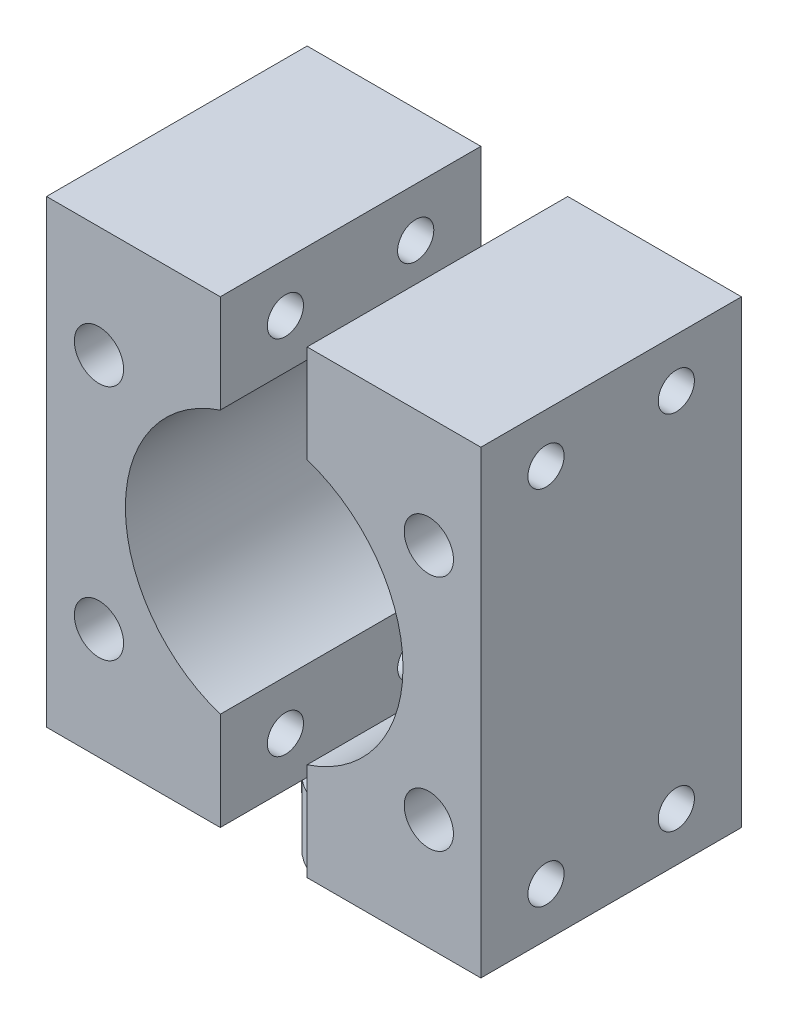
ISO-10303-21;
HEADER;
FILE_DESCRIPTION(('STEP AP214'),'2;1');
FILE_NAME('part.step','',(''),(''),'','','');
FILE_SCHEMA(('AUTOMOTIVE_DESIGN { 1 0 10303 214 1 1 1 1 }'));
ENDSEC;
DATA;
#1=APPLICATION_CONTEXT('core data for automotive mechanical design processes');
#2=APPLICATION_PROTOCOL_DEFINITION('international standard','automotive_design',2000,#1);
#3=PRODUCT_CONTEXT('',#1,'mechanical');
#4=PRODUCT('Part','Part','',(#3));
#5=PRODUCT_RELATED_PRODUCT_CATEGORY('part','',(#4));
#6=PRODUCT_DEFINITION_FORMATION('','',#4);
#7=PRODUCT_DEFINITION_CONTEXT('part definition',#1,'design');
#8=PRODUCT_DEFINITION('design','',#6,#7);
#9=PRODUCT_DEFINITION_SHAPE('','',#8);
#10=(LENGTH_UNIT() NAMED_UNIT(*) SI_UNIT(.MILLI.,.METRE.));
#11=(NAMED_UNIT(*) PLANE_ANGLE_UNIT() SI_UNIT($,.RADIAN.));
#12=(NAMED_UNIT(*) SI_UNIT($,.STERADIAN.) SOLID_ANGLE_UNIT());
#13=UNCERTAINTY_MEASURE_WITH_UNIT(LENGTH_MEASURE(1.E-05),#10,'distance_accuracy_value','');
#14=(GEOMETRIC_REPRESENTATION_CONTEXT(3) GLOBAL_UNCERTAINTY_ASSIGNED_CONTEXT((#13)) GLOBAL_UNIT_ASSIGNED_CONTEXT((#10,
#11,#12)) REPRESENTATION_CONTEXT('',''));
#15=CARTESIAN_POINT('',(0.,0.,0.));
#16=DIRECTION('',(0.,0.,1.));
#17=DIRECTION('',(1.,0.,0.));
#18=AXIS2_PLACEMENT_3D('',#15,#16,#17);
#19=CARTESIAN_POINT('',(-15.,4.5,-8.65612108217187));
#20=DIRECTION('',(0.,-1.,0.));
#21=DIRECTION('',(0.,0.,-1.));
#22=AXIS2_PLACEMENT_3D('',#19,#20,#21);
#23=PLANE('',#22);
#24=DIRECTION('',(0.,0.,-1.));
#25=VECTOR('',#24,1.);
#26=CARTESIAN_POINT('',(-3.,4.5,-8.65612108217187));
#27=LINE('',#26,#25);
#28=CARTESIAN_POINT('',(-3.,4.5,-3.68272996566406));
#29=VERTEX_POINT('',#28);
#30=CARTESIAN_POINT('',(-3.,4.5,-8.65612108217187));
#31=VERTEX_POINT('',#30);
#32=EDGE_CURVE('E204',#29,#31,#27,.T.);
#33=ORIENTED_EDGE('',*,*,#32,.F.);
#34=CARTESIAN_POINT('',(0.,4.5,0.));
#35=DIRECTION('',(0.,1.,0.));
#36=DIRECTION('',(0.,0.,1.));
#37=AXIS2_PLACEMENT_3D('',#34,#35,#36);
#38=CIRCLE('',#37,4.75);
#39=CARTESIAN_POINT('',(-3.,4.5,3.68272996566406));
#40=VERTEX_POINT('',#39);
#41=EDGE_CURVE('E146',#29,#40,#38,.T.);
#42=ORIENTED_EDGE('',*,*,#41,.T.);
#43=CARTESIAN_POINT('',(-3.,4.5,9.34387891782813));
#44=VERTEX_POINT('',#43);
#45=EDGE_CURVE('E194',#44,#40,#27,.T.);
#46=ORIENTED_EDGE('',*,*,#45,.F.);
#47=DIRECTION('',(1.,0.,0.));
#48=VECTOR('',#47,1.);
#49=CARTESIAN_POINT('',(-3.,4.5,9.34387891782813));
#50=LINE('',#49,#48);
#51=CARTESIAN_POINT('',(-15.,4.5,9.34387891782813));
#52=VERTEX_POINT('',#51);
#53=EDGE_CURVE('E203',#52,#44,#50,.T.);
#54=ORIENTED_EDGE('',*,*,#53,.F.);
#55=DIRECTION('',(0.,0.,1.));
#56=VECTOR('',#55,1.);
#57=CARTESIAN_POINT('',(-15.,4.5,9.34387891782813));
#58=LINE('',#57,#56);
#59=CARTESIAN_POINT('',(-15.,4.5,-8.65612108217187));
#60=VERTEX_POINT('',#59);
#61=EDGE_CURVE('E201',#60,#52,#58,.T.);
#62=ORIENTED_EDGE('',*,*,#61,.F.);
#63=DIRECTION('',(-1.,0.,0.));
#64=VECTOR('',#63,1.);
#65=CARTESIAN_POINT('',(-3.,4.5,-8.65612108217187));
#66=LINE('',#65,#64);
#67=EDGE_CURVE('E189',#31,#60,#66,.T.);
#68=ORIENTED_EDGE('',*,*,#67,.F.);
#69=EDGE_LOOP('',(#33,#42,#46,#54,#62,#68));
#70=FACE_BOUND('',#69,.T.);
#71=ADVANCED_FACE('F41',(#70),#23,.T.);
#72=CARTESIAN_POINT('',(-3.,36.25,-8.65612108217187));
#73=DIRECTION('',(0.,0.,1.));
#74=DIRECTION('',(1.,0.,0.));
#75=AXIS2_PLACEMENT_3D('',#72,#73,#74);
#76=PLANE('',#75);
#77=CARTESIAN_POINT('',(-11.3772186390947,28.569859147129,-8.65612108217187));
#78=DIRECTION('',(0.,0.,1.));
#79=DIRECTION('',(1.,0.,0.));
#80=AXIS2_PLACEMENT_3D('',#77,#78,#79);
#81=CIRCLE('',#80,1.7);
#82=CARTESIAN_POINT('',(-9.67721863909473,28.569859147129,-8.65612108217187));
#83=VERTEX_POINT('',#82);
#84=EDGE_CURVE('E415',#83,#83,#81,.T.);
#85=ORIENTED_EDGE('',*,*,#84,.T.);
#86=EDGE_LOOP('',(#85));
#87=FACE_BOUND('',#86,.T.);
#88=CARTESIAN_POINT('',(-11.3772186390947,12.180140852871,-8.65612108217187));
#89=DIRECTION('',(0.,0.,1.));
#90=DIRECTION('',(1.,0.,0.));
#91=AXIS2_PLACEMENT_3D('',#88,#89,#90);
#92=CIRCLE('',#91,1.7);
#93=CARTESIAN_POINT('',(-9.67721863909473,12.180140852871,-8.65612108217187));
#94=VERTEX_POINT('',#93);
#95=EDGE_CURVE('E409',#94,#94,#92,.T.);
#96=ORIENTED_EDGE('',*,*,#95,.T.);
#97=EDGE_LOOP('',(#96));
#98=FACE_BOUND('',#97,.T.);
#99=ORIENTED_EDGE('',*,*,#67,.T.);
#100=DIRECTION('',(0.,-1.,0.));
#101=VECTOR('',#100,1.);
#102=CARTESIAN_POINT('',(-15.,36.25,-8.65612108217187));
#103=LINE('',#102,#101);
#104=CARTESIAN_POINT('',(-15.,36.25,-8.65612108217187));
#105=VERTEX_POINT('',#104);
#106=EDGE_CURVE('E138',#105,#60,#103,.T.);
#107=ORIENTED_EDGE('',*,*,#106,.F.);
#108=DIRECTION('',(-1.,0.,0.));
#109=VECTOR('',#108,1.);
#110=CARTESIAN_POINT('',(-3.,36.25,-8.65612108217187));
#111=LINE('',#110,#109);
#112=CARTESIAN_POINT('',(-3.,36.25,-8.65612108217187));
#113=VERTEX_POINT('',#112);
#114=EDGE_CURVE('E190',#113,#105,#111,.T.);
#115=ORIENTED_EDGE('',*,*,#114,.F.);
#116=DIRECTION('',(0.,-1.,0.));
#117=VECTOR('',#116,1.);
#118=CARTESIAN_POINT('',(-3.,36.25,-8.65612108217187));
#119=LINE('',#118,#117);
#120=EDGE_CURVE('E140',#113,#31,#119,.T.);
#121=ORIENTED_EDGE('',*,*,#120,.T.);
#122=EDGE_LOOP('',(#99,#107,#115,#121));
#123=FACE_BOUND('',#122,.T.);
#124=ADVANCED_FACE('F43',(#87,#98,#123),#76,.F.);
#125=CARTESIAN_POINT('',(-15.,36.25,9.34387891782813));
#126=DIRECTION('',(1.,0.,0.));
#127=DIRECTION('',(0.,0.,-1.));
#128=AXIS2_PLACEMENT_3D('',#125,#126,#127);
#129=PLANE('',#128);
#130=CARTESIAN_POINT('',(-15.,32.8715786406462,4.84387891782813));
#131=DIRECTION('',(1.,0.,0.));
#132=DIRECTION('',(0.,0.,-1.));
#133=AXIS2_PLACEMENT_3D('',#130,#131,#132);
#134=CIRCLE('',#133,1.24999999999999);
#135=CARTESIAN_POINT('',(-15.,32.8715786406462,3.59387891782814));
#136=VERTEX_POINT('',#135);
#137=EDGE_CURVE('E166',#136,#136,#134,.T.);
#138=ORIENTED_EDGE('',*,*,#137,.T.);
#139=EDGE_LOOP('',(#138));
#140=FACE_BOUND('',#139,.T.);
#141=CARTESIAN_POINT('',(-15.,32.8715786406462,-4.15612108217187));
#142=DIRECTION('',(1.,0.,0.));
#143=DIRECTION('',(0.,0.,-1.));
#144=AXIS2_PLACEMENT_3D('',#141,#142,#143);
#145=CIRCLE('',#144,1.24999999999999);
#146=CARTESIAN_POINT('',(-15.,32.8715786406462,-5.40612108217186));
#147=VERTEX_POINT('',#146);
#148=EDGE_CURVE('E156',#147,#147,#145,.T.);
#149=ORIENTED_EDGE('',*,*,#148,.T.);
#150=EDGE_LOOP('',(#149));
#151=FACE_BOUND('',#150,.T.);
#152=CARTESIAN_POINT('',(-15.,7.87842135935374,4.84387891782813));
#153=DIRECTION('',(1.,0.,0.));
#154=DIRECTION('',(0.,0.,-1.));
#155=AXIS2_PLACEMENT_3D('',#152,#153,#154);
#156=CIRCLE('',#155,1.24999999999999);
#157=CARTESIAN_POINT('',(-15.,7.87842135935374,3.59387891782814));
#158=VERTEX_POINT('',#157);
#159=EDGE_CURVE('E153',#158,#158,#156,.T.);
#160=ORIENTED_EDGE('',*,*,#159,.T.);
#161=EDGE_LOOP('',(#160));
#162=FACE_BOUND('',#161,.T.);
#163=CARTESIAN_POINT('',(-15.,7.87842135935374,-4.15612108217187));
#164=DIRECTION('',(1.,0.,0.));
#165=DIRECTION('',(0.,0.,-1.));
#166=AXIS2_PLACEMENT_3D('',#163,#164,#165);
#167=CIRCLE('',#166,1.24999999999999);
#168=CARTESIAN_POINT('',(-15.,7.87842135935374,-5.40612108217186));
#169=VERTEX_POINT('',#168);
#170=EDGE_CURVE('E150',#169,#169,#167,.T.);
#171=ORIENTED_EDGE('',*,*,#170,.T.);
#172=EDGE_LOOP('',(#171));
#173=FACE_BOUND('',#172,.T.);
#174=ORIENTED_EDGE('',*,*,#61,.T.);
#175=DIRECTION('',(0.,-1.,0.));
#176=VECTOR('',#175,1.);
#177=CARTESIAN_POINT('',(-15.,36.25,9.34387891782813));
#178=LINE('',#177,#176);
#179=CARTESIAN_POINT('',(-15.,36.25,9.34387891782813));
#180=VERTEX_POINT('',#179);
#181=EDGE_CURVE('E135',#180,#52,#178,.T.);
#182=ORIENTED_EDGE('',*,*,#181,.F.);
#183=DIRECTION('',(0.,0.,1.));
#184=VECTOR('',#183,1.);
#185=CARTESIAN_POINT('',(-15.,36.25,9.34387891782813));
#186=LINE('',#185,#184);
#187=EDGE_CURVE('E193',#105,#180,#186,.T.);
#188=ORIENTED_EDGE('',*,*,#187,.F.);
#189=ORIENTED_EDGE('',*,*,#106,.T.);
#190=EDGE_LOOP('',(#174,#182,#188,#189));
#191=FACE_BOUND('',#190,.T.);
#192=ADVANCED_FACE('F220',(#140,#151,#162,#173,#191),#129,.F.);
#193=CARTESIAN_POINT('',(-3.,36.25,9.34387891782813));
#194=DIRECTION('',(0.,0.,-1.));
#195=DIRECTION('',(-1.,0.,0.));
#196=AXIS2_PLACEMENT_3D('',#193,#194,#195);
#197=PLANE('',#196);
#198=CARTESIAN_POINT('',(-11.3772186390947,28.569859147129,9.34387891782813));
#199=DIRECTION('',(0.,0.,1.));
#200=DIRECTION('',(1.,0.,0.));
#201=AXIS2_PLACEMENT_3D('',#198,#199,#200);
#202=CIRCLE('',#201,1.69999999999999);
#203=CARTESIAN_POINT('',(-9.67721863909474,28.569859147129,9.34387891782813));
#204=VERTEX_POINT('',#203);
#205=EDGE_CURVE('E420',#204,#204,#202,.T.);
#206=ORIENTED_EDGE('',*,*,#205,.F.);
#207=EDGE_LOOP('',(#206));
#208=FACE_BOUND('',#207,.T.);
#209=CARTESIAN_POINT('',(-11.3772186390947,12.180140852871,9.34387891782813));
#210=DIRECTION('',(0.,0.,1.));
#211=DIRECTION('',(1.,0.,0.));
#212=AXIS2_PLACEMENT_3D('',#209,#210,#211);
#213=CIRCLE('',#212,1.69999999999999);
#214=CARTESIAN_POINT('',(-9.67721863909474,12.180140852871,9.34387891782813));
#215=VERTEX_POINT('',#214);
#216=EDGE_CURVE('E411',#215,#215,#213,.T.);
#217=ORIENTED_EDGE('',*,*,#216,.F.);
#218=EDGE_LOOP('',(#217));
#219=FACE_BOUND('',#218,.T.);
#220=DIRECTION('',(0.,-1.,0.));
#221=VECTOR('',#220,1.);
#222=CARTESIAN_POINT('',(-3.,36.25,9.34387891782813));
#223=LINE('',#222,#221);
#224=CARTESIAN_POINT('',(-3.,11.2790892751317,9.34387891782813));
#225=VERTEX_POINT('',#224);
#226=EDGE_CURVE('E129',#225,#44,#223,.T.);
#227=ORIENTED_EDGE('',*,*,#226,.F.);
#228=CARTESIAN_POINT('',(0.0337666909677441,20.375,9.34387891782813));
#229=DIRECTION('',(0.,0.,1.));
#230=DIRECTION('',(1.,0.,0.));
#231=AXIS2_PLACEMENT_3D('',#228,#229,#230);
#232=CIRCLE('',#231,9.5885);
#233=CARTESIAN_POINT('',(-3.,29.4709107248683,9.34387891782813));
#234=VERTEX_POINT('',#233);
#235=EDGE_CURVE('E115',#234,#225,#232,.T.);
#236=ORIENTED_EDGE('',*,*,#235,.F.);
#237=CARTESIAN_POINT('',(-3.,36.25,9.34387891782813));
#238=VERTEX_POINT('',#237);
#239=EDGE_CURVE('E126',#238,#234,#223,.T.);
#240=ORIENTED_EDGE('',*,*,#239,.F.);
#241=DIRECTION('',(1.,0.,0.));
#242=VECTOR('',#241,1.);
#243=CARTESIAN_POINT('',(-3.,36.25,9.34387891782813));
#244=LINE('',#243,#242);
#245=EDGE_CURVE('E196',#180,#238,#244,.T.);
#246=ORIENTED_EDGE('',*,*,#245,.F.);
#247=ORIENTED_EDGE('',*,*,#181,.T.);
#248=ORIENTED_EDGE('',*,*,#53,.T.);
#249=EDGE_LOOP('',(#227,#236,#240,#246,#247,#248));
#250=FACE_BOUND('',#249,.T.);
#251=ADVANCED_FACE('F124',(#208,#219,#250),#197,.F.);
#252=CARTESIAN_POINT('',(-3.,36.25,-8.65612108217187));
#253=DIRECTION('',(-1.,0.,0.));
#254=DIRECTION('',(0.,0.,1.));
#255=AXIS2_PLACEMENT_3D('',#252,#253,#254);
#256=PLANE('',#255);
#257=CARTESIAN_POINT('',(-3.,32.8715786406462,4.84387891782813));
#258=DIRECTION('',(-1.,0.,0.));
#259=DIRECTION('',(0.,0.,1.));
#260=AXIS2_PLACEMENT_3D('',#257,#258,#259);
#261=CIRCLE('',#260,1.24999999999999);
#262=CARTESIAN_POINT('',(-3.,32.8715786406462,6.09387891782812));
#263=VERTEX_POINT('',#262);
#264=EDGE_CURVE('E45',#263,#263,#261,.T.);
#265=ORIENTED_EDGE('',*,*,#264,.T.);
#266=EDGE_LOOP('',(#265));
#267=FACE_BOUND('',#266,.T.);
#268=CARTESIAN_POINT('',(-3.,32.8715786406462,-4.15612108217187));
#269=DIRECTION('',(-1.,0.,0.));
#270=DIRECTION('',(0.,0.,1.));
#271=AXIS2_PLACEMENT_3D('',#268,#269,#270);
#272=CIRCLE('',#271,1.24999999999999);
#273=CARTESIAN_POINT('',(-3.,32.8715786406462,-2.90612108217188));
#274=VERTEX_POINT('',#273);
#275=EDGE_CURVE('E154',#274,#274,#272,.T.);
#276=ORIENTED_EDGE('',*,*,#275,.T.);
#277=EDGE_LOOP('',(#276));
#278=FACE_BOUND('',#277,.T.);
#279=CARTESIAN_POINT('',(-3.,7.87842135935374,4.84387891782813));
#280=DIRECTION('',(-1.,0.,0.));
#281=DIRECTION('',(0.,0.,1.));
#282=AXIS2_PLACEMENT_3D('',#279,#280,#281);
#283=CIRCLE('',#282,1.24999999999999);
#284=CARTESIAN_POINT('',(-3.,7.87842135935374,6.09387891782812));
#285=VERTEX_POINT('',#284);
#286=EDGE_CURVE('E151',#285,#285,#283,.T.);
#287=ORIENTED_EDGE('',*,*,#286,.T.);
#288=EDGE_LOOP('',(#287));
#289=FACE_BOUND('',#288,.T.);
#290=CARTESIAN_POINT('',(-3.,7.87842135935374,-4.15612108217187));
#291=DIRECTION('',(-1.,0.,0.));
#292=DIRECTION('',(0.,0.,1.));
#293=AXIS2_PLACEMENT_3D('',#290,#291,#292);
#294=CIRCLE('',#293,1.24999999999999);
#295=CARTESIAN_POINT('',(-3.,7.87842135935374,-2.90612108217188));
#296=VERTEX_POINT('',#295);
#297=EDGE_CURVE('E130',#296,#296,#294,.T.);
#298=ORIENTED_EDGE('',*,*,#297,.T.);
#299=EDGE_LOOP('',(#298));
#300=FACE_BOUND('',#299,.T.);
#301=DIRECTION('',(0.,1.,0.));
#302=VECTOR('',#301,1.);
#303=CARTESIAN_POINT('',(-3.,36.25,-7.65612108217187));
#304=LINE('',#303,#302);
#305=CARTESIAN_POINT('',(-3.,11.2790892751317,-7.65612108217187));
#306=VERTEX_POINT('',#305);
#307=CARTESIAN_POINT('',(-3.,29.4709107248683,-7.65612108217187));
#308=VERTEX_POINT('',#307);
#309=EDGE_CURVE('E119',#306,#308,#304,.T.);
#310=ORIENTED_EDGE('',*,*,#309,.F.);
#311=DIRECTION('',(0.,0.,1.));
#312=VECTOR('',#311,1.);
#313=CARTESIAN_POINT('',(-3.,11.2790892751317,-7.65612108217187));
#314=LINE('',#313,#312);
#315=EDGE_CURVE('E12',#306,#225,#314,.T.);
#316=ORIENTED_EDGE('',*,*,#315,.T.);
#317=ORIENTED_EDGE('',*,*,#226,.T.);
#318=ORIENTED_EDGE('',*,*,#45,.T.);
#319=EDGE_CURVE('E206',#40,#29,#27,.T.);
#320=ORIENTED_EDGE('',*,*,#319,.T.);
#321=ORIENTED_EDGE('',*,*,#32,.T.);
#322=ORIENTED_EDGE('',*,*,#120,.F.);
#323=DIRECTION('',(0.,0.,-1.));
#324=VECTOR('',#323,1.);
#325=CARTESIAN_POINT('',(-3.,36.25,-8.65612108217187));
#326=LINE('',#325,#324);
#327=EDGE_CURVE('E134',#238,#113,#326,.T.);
#328=ORIENTED_EDGE('',*,*,#327,.F.);
#329=ORIENTED_EDGE('',*,*,#239,.T.);
#330=DIRECTION('',(0.,0.,1.));
#331=VECTOR('',#330,1.);
#332=CARTESIAN_POINT('',(-3.,29.4709107248683,-7.65612108217187));
#333=LINE('',#332,#331);
#334=EDGE_CURVE('E50',#234,#308,#333,.F.);
#335=ORIENTED_EDGE('',*,*,#334,.T.);
#336=EDGE_LOOP('',(#310,#316,#317,#318,#320,#321,#322,#328,#329,#335));
#337=FACE_BOUND('',#336,.T.);
#338=ADVANCED_FACE('F132',(#267,#278,#289,#300,#337),#256,.F.);
#339=CARTESIAN_POINT('',(-15.,36.25,-8.65612108217187));
#340=DIRECTION('',(0.,-1.,0.));
#341=DIRECTION('',(0.,0.,-1.));
#342=AXIS2_PLACEMENT_3D('',#339,#340,#341);
#343=PLANE('',#342);
#344=ORIENTED_EDGE('',*,*,#114,.T.);
#345=ORIENTED_EDGE('',*,*,#187,.T.);
#346=ORIENTED_EDGE('',*,*,#245,.T.);
#347=ORIENTED_EDGE('',*,*,#327,.T.);
#348=EDGE_LOOP('',(#344,#345,#346,#347));
#349=FACE_BOUND('',#348,.T.);
#350=ADVANCED_FACE('F222',(#349),#343,.F.);
#351=CARTESIAN_POINT('',(-10.5914213562373,4.5,0.));
#352=DIRECTION('',(0.,1.,0.));
#353=DIRECTION('',(0.,0.,1.));
#354=AXIS2_PLACEMENT_3D('',#351,#352,#353);
#355=PLANE('',#354);
#356=ORIENTED_EDGE('',*,*,#319,.F.);
#357=CARTESIAN_POINT('',(-1.5,4.5,4.50693909432999));
#358=VERTEX_POINT('',#357);
#359=EDGE_CURVE('E65',#40,#358,#38,.T.);
#360=ORIENTED_EDGE('',*,*,#359,.T.);
#361=DIRECTION('',(0.,0.,1.));
#362=VECTOR('',#361,1.);
#363=CARTESIAN_POINT('',(-1.5,4.5,0.));
#364=LINE('',#363,#362);
#365=CARTESIAN_POINT('',(-1.5,4.5,-4.50693909432999));
#366=VERTEX_POINT('',#365);
#367=EDGE_CURVE('E174',#366,#358,#364,.T.);
#368=ORIENTED_EDGE('',*,*,#367,.F.);
#369=EDGE_CURVE('E178',#366,#29,#38,.T.);
#370=ORIENTED_EDGE('',*,*,#369,.T.);
#371=EDGE_LOOP('',(#356,#360,#368,#370));
#372=FACE_BOUND('',#371,.T.);
#373=ADVANCED_FACE('F226',(#372),#355,.T.);
#374=CARTESIAN_POINT('',(-1.5,4.5,0.));
#375=DIRECTION('',(1.,0.,0.));
#376=DIRECTION('',(0.,0.,-1.));
#377=AXIS2_PLACEMENT_3D('',#374,#375,#376);
#378=PLANE('',#377);
#379=DIRECTION('',(0.,0.,1.));
#380=VECTOR('',#379,1.);
#381=CARTESIAN_POINT('',(-1.5,0.,0.));
#382=LINE('',#381,#380);
#383=CARTESIAN_POINT('',(-1.5,0.,-4.50693909432999));
#384=VERTEX_POINT('',#383);
#385=CARTESIAN_POINT('',(-1.5,0.,4.50693909432999));
#386=VERTEX_POINT('',#385);
#387=EDGE_CURVE('E172',#384,#386,#382,.T.);
#388=ORIENTED_EDGE('',*,*,#387,.F.);
#389=DIRECTION('',(0.,-1.,0.));
#390=VECTOR('',#389,1.);
#391=CARTESIAN_POINT('',(-1.5,4.5,-4.50693909432999));
#392=LINE('',#391,#390);
#393=EDGE_CURVE('E187',#366,#384,#392,.T.);
#394=ORIENTED_EDGE('',*,*,#393,.F.);
#395=ORIENTED_EDGE('',*,*,#367,.T.);
#396=DIRECTION('',(0.,-1.,0.));
#397=VECTOR('',#396,1.);
#398=CARTESIAN_POINT('',(-1.5,4.5,4.50693909432999));
#399=LINE('',#398,#397);
#400=EDGE_CURVE('E181',#358,#386,#399,.T.);
#401=ORIENTED_EDGE('',*,*,#400,.T.);
#402=EDGE_LOOP('',(#388,#394,#395,#401));
#403=FACE_BOUND('',#402,.T.);
#404=ADVANCED_FACE('F231',(#403),#378,.T.);
#405=CARTESIAN_POINT('',(0.,4.5,0.));
#406=DIRECTION('',(0.,-1.,0.));
#407=DIRECTION('',(0.,0.,-1.));
#408=AXIS2_PLACEMENT_3D('',#405,#406,#407);
#409=CYLINDRICAL_SURFACE('',#408,4.75);
#410=CARTESIAN_POINT('',(0.,0.,0.));
#411=DIRECTION('',(0.,1.,0.));
#412=DIRECTION('',(0.,0.,1.));
#413=AXIS2_PLACEMENT_3D('',#410,#411,#412);
#414=CIRCLE('',#413,4.75);
#415=EDGE_CURVE('E177',#384,#386,#414,.T.);
#416=ORIENTED_EDGE('',*,*,#415,.T.);
#417=ORIENTED_EDGE('',*,*,#400,.F.);
#418=ORIENTED_EDGE('',*,*,#359,.F.);
#419=ORIENTED_EDGE('',*,*,#41,.F.);
#420=ORIENTED_EDGE('',*,*,#369,.F.);
#421=ORIENTED_EDGE('',*,*,#393,.T.);
#422=EDGE_LOOP('',(#416,#417,#418,#419,#420,#421));
#423=FACE_BOUND('',#422,.T.);
#424=ADVANCED_FACE('F227',(#423),#409,.T.);
#425=CARTESIAN_POINT('',(-10.5914213562373,0.,0.));
#426=DIRECTION('',(0.,1.,0.));
#427=DIRECTION('',(0.,0.,1.));
#428=AXIS2_PLACEMENT_3D('',#425,#426,#427);
#429=PLANE('',#428);
#430=ORIENTED_EDGE('',*,*,#387,.T.);
#431=ORIENTED_EDGE('',*,*,#415,.F.);
#432=EDGE_LOOP('',(#430,#431));
#433=FACE_BOUND('',#432,.T.);
#434=ADVANCED_FACE('F233',(#433),#429,.F.);
#435=CARTESIAN_POINT('',(0.0337666909677441,20.375,-7.65612108217187));
#436=DIRECTION('',(0.,0.,1.));
#437=DIRECTION('',(1.,0.,0.));
#438=AXIS2_PLACEMENT_3D('',#435,#436,#437);
#439=CYLINDRICAL_SURFACE('',#438,9.5885);
#440=CARTESIAN_POINT('',(0.0337666909677441,20.375,-7.65612108217187));
#441=DIRECTION('',(0.,0.,1.));
#442=DIRECTION('',(1.,0.,0.));
#443=AXIS2_PLACEMENT_3D('',#440,#441,#442);
#444=CIRCLE('',#443,9.5885);
#445=EDGE_CURVE('E57',#308,#306,#444,.T.);
#446=ORIENTED_EDGE('',*,*,#445,.F.);
#447=ORIENTED_EDGE('',*,*,#334,.F.);
#448=ORIENTED_EDGE('',*,*,#235,.T.);
#449=ORIENTED_EDGE('',*,*,#315,.F.);
#450=EDGE_LOOP('',(#446,#447,#448,#449));
#451=FACE_BOUND('',#450,.T.);
#452=ADVANCED_FACE('F114',(#451),#439,.F.);
#453=CARTESIAN_POINT('',(0.0337666909677441,20.375,-7.65612108217187));
#454=DIRECTION('',(0.,0.,1.));
#455=DIRECTION('',(1.,0.,0.));
#456=AXIS2_PLACEMENT_3D('',#453,#454,#455);
#457=PLANE('',#456);
#458=ORIENTED_EDGE('',*,*,#309,.T.);
#459=ORIENTED_EDGE('',*,*,#445,.T.);
#460=EDGE_LOOP('',(#458,#459));
#461=FACE_BOUND('',#460,.T.);
#462=ADVANCED_FACE('F240',(#461),#457,.T.);
#463=CARTESIAN_POINT('',(15.,7.87842135935374,-4.15612108217187));
#464=DIRECTION('',(1.,0.,0.));
#465=DIRECTION('',(0.,0.,-1.));
#466=AXIS2_PLACEMENT_3D('',#463,#464,#465);
#467=CYLINDRICAL_SURFACE('',#466,1.24999999999999);
#468=ORIENTED_EDGE('',*,*,#170,.F.);
#469=EDGE_LOOP('',(#468));
#470=FACE_BOUND('',#469,.T.);
#471=ORIENTED_EDGE('',*,*,#297,.F.);
#472=EDGE_LOOP('',(#471));
#473=FACE_BOUND('',#472,.T.);
#474=ADVANCED_FACE('F269',(#470,#473),#467,.F.);
#475=CARTESIAN_POINT('',(15.,7.87842135935374,4.84387891782813));
#476=DIRECTION('',(1.,0.,0.));
#477=DIRECTION('',(0.,0.,-1.));
#478=AXIS2_PLACEMENT_3D('',#475,#476,#477);
#479=CYLINDRICAL_SURFACE('',#478,1.24999999999999);
#480=ORIENTED_EDGE('',*,*,#159,.F.);
#481=EDGE_LOOP('',(#480));
#482=FACE_BOUND('',#481,.T.);
#483=ORIENTED_EDGE('',*,*,#286,.F.);
#484=EDGE_LOOP('',(#483));
#485=FACE_BOUND('',#484,.T.);
#486=ADVANCED_FACE('F272',(#482,#485),#479,.F.);
#487=CARTESIAN_POINT('',(15.,32.8715786406462,-4.15612108217187));
#488=DIRECTION('',(1.,0.,0.));
#489=DIRECTION('',(0.,0.,-1.));
#490=AXIS2_PLACEMENT_3D('',#487,#488,#489);
#491=CYLINDRICAL_SURFACE('',#490,1.24999999999999);
#492=ORIENTED_EDGE('',*,*,#148,.F.);
#493=EDGE_LOOP('',(#492));
#494=FACE_BOUND('',#493,.T.);
#495=ORIENTED_EDGE('',*,*,#275,.F.);
#496=EDGE_LOOP('',(#495));
#497=FACE_BOUND('',#496,.T.);
#498=ADVANCED_FACE('F280',(#494,#497),#491,.F.);
#499=CARTESIAN_POINT('',(15.,32.8715786406462,4.84387891782813));
#500=DIRECTION('',(1.,0.,0.));
#501=DIRECTION('',(0.,0.,-1.));
#502=AXIS2_PLACEMENT_3D('',#499,#500,#501);
#503=CYLINDRICAL_SURFACE('',#502,1.24999999999999);
#504=ORIENTED_EDGE('',*,*,#137,.F.);
#505=EDGE_LOOP('',(#504));
#506=FACE_BOUND('',#505,.T.);
#507=ORIENTED_EDGE('',*,*,#264,.F.);
#508=EDGE_LOOP('',(#507));
#509=FACE_BOUND('',#508,.T.);
#510=ADVANCED_FACE('F316',(#506,#509),#503,.F.);
#511=CARTESIAN_POINT('',(-11.3772186390947,12.180140852871,9.34387891782813));
#512=DIRECTION('',(0.,0.,1.));
#513=DIRECTION('',(1.,0.,0.));
#514=AXIS2_PLACEMENT_3D('',#511,#512,#513);
#515=CYLINDRICAL_SURFACE('',#514,1.69999999999999);
#516=ORIENTED_EDGE('',*,*,#95,.F.);
#517=EDGE_LOOP('',(#516));
#518=FACE_BOUND('',#517,.T.);
#519=ORIENTED_EDGE('',*,*,#216,.T.);
#520=EDGE_LOOP('',(#519));
#521=FACE_BOUND('',#520,.T.);
#522=ADVANCED_FACE('F310',(#518,#521),#515,.F.);
#523=CARTESIAN_POINT('',(-11.3772186390947,28.569859147129,9.34387891782813));
#524=DIRECTION('',(0.,0.,1.));
#525=DIRECTION('',(1.,0.,0.));
#526=AXIS2_PLACEMENT_3D('',#523,#524,#525);
#527=CYLINDRICAL_SURFACE('',#526,1.69999999999999);
#528=ORIENTED_EDGE('',*,*,#84,.F.);
#529=EDGE_LOOP('',(#528));
#530=FACE_BOUND('',#529,.T.);
#531=ORIENTED_EDGE('',*,*,#205,.T.);
#532=EDGE_LOOP('',(#531));
#533=FACE_BOUND('',#532,.T.);
#534=ADVANCED_FACE('F315',(#530,#533),#527,.F.);
#535=CLOSED_SHELL('',(#71,#124,#192,#251,#338,#350,#373,#404,#424,#434,#452,#462,#474,#486,#498,
#510,#522,#534));
#536=MANIFOLD_SOLID_BREP('B2',#535);
#537=CARTESIAN_POINT('',(3.,36.25,-8.65612108217187));
#538=DIRECTION('',(0.,0.,1.));
#539=DIRECTION('',(1.,0.,0.));
#540=AXIS2_PLACEMENT_3D('',#537,#538,#539);
#541=PLANE('',#540);
#542=CARTESIAN_POINT('',(11.4050067096299,12.171834609744,-8.65612108217187));
#543=DIRECTION('',(0.,0.,1.));
#544=DIRECTION('',(1.,0.,0.));
#545=AXIS2_PLACEMENT_3D('',#542,#543,#544);
#546=CIRCLE('',#545,1.7);
#547=CARTESIAN_POINT('',(13.1050067096299,12.171834609744,-8.65612108217187));
#548=VERTEX_POINT('',#547);
#549=EDGE_CURVE('E600',#548,#548,#546,.T.);
#550=ORIENTED_EDGE('',*,*,#549,.T.);
#551=EDGE_LOOP('',(#550));
#552=FACE_BOUND('',#551,.T.);
#553=CARTESIAN_POINT('',(11.4050067096299,28.578165390256,-8.65612108217187));
#554=DIRECTION('',(0.,0.,1.));
#555=DIRECTION('',(1.,0.,0.));
#556=AXIS2_PLACEMENT_3D('',#553,#554,#555);
#557=CIRCLE('',#556,1.7);
#558=CARTESIAN_POINT('',(13.1050067096299,28.578165390256,-8.65612108217187));
#559=VERTEX_POINT('',#558);
#560=EDGE_CURVE('E594',#559,#559,#557,.T.);
#561=ORIENTED_EDGE('',*,*,#560,.T.);
#562=EDGE_LOOP('',(#561));
#563=FACE_BOUND('',#562,.T.);
#564=DIRECTION('',(-1.,0.,0.));
#565=VECTOR('',#564,1.);
#566=CARTESIAN_POINT('',(3.,4.5,-8.65612108217187));
#567=LINE('',#566,#565);
#568=CARTESIAN_POINT('',(15.,4.5,-8.65612108217187));
#569=VERTEX_POINT('',#568);
#570=CARTESIAN_POINT('',(3.,4.5,-8.65612108217187));
#571=VERTEX_POINT('',#570);
#572=EDGE_CURVE('E538',#569,#571,#567,.T.);
#573=ORIENTED_EDGE('',*,*,#572,.T.);
#574=DIRECTION('',(0.,-1.,0.));
#575=VECTOR('',#574,1.);
#576=CARTESIAN_POINT('',(3.,36.25,-8.65612108217187));
#577=LINE('',#576,#575);
#578=CARTESIAN_POINT('',(3.,36.25,-8.65612108217187));
#579=VERTEX_POINT('',#578);
#580=EDGE_CURVE('E567',#579,#571,#577,.T.);
#581=ORIENTED_EDGE('',*,*,#580,.F.);
#582=DIRECTION('',(-1.,0.,0.));
#583=VECTOR('',#582,1.);
#584=CARTESIAN_POINT('',(3.,36.25,-8.65612108217187));
#585=LINE('',#584,#583);
#586=CARTESIAN_POINT('',(15.,36.25,-8.65612108217187));
#587=VERTEX_POINT('',#586);
#588=EDGE_CURVE('E539',#587,#579,#585,.T.);
#589=ORIENTED_EDGE('',*,*,#588,.F.);
#590=DIRECTION('',(0.,-1.,0.));
#591=VECTOR('',#590,1.);
#592=CARTESIAN_POINT('',(15.,36.25,-8.65612108217187));
#593=LINE('',#592,#591);
#594=EDGE_CURVE('E549',#587,#569,#593,.T.);
#595=ORIENTED_EDGE('',*,*,#594,.T.);
#596=EDGE_LOOP('',(#573,#581,#589,#595));
#597=FACE_BOUND('',#596,.T.);
#598=ADVANCED_FACE('F430',(#552,#563,#597),#541,.F.);
#599=CARTESIAN_POINT('',(3.,36.25,-8.65612108217187));
#600=DIRECTION('',(1.,0.,0.));
#601=DIRECTION('',(0.,0.,-1.));
#602=AXIS2_PLACEMENT_3D('',#599,#600,#601);
#603=PLANE('',#602);
#604=CARTESIAN_POINT('',(3.,32.8715786406462,4.84387891782813));
#605=DIRECTION('',(1.,0.,0.));
#606=DIRECTION('',(0.,0.,-1.));
#607=AXIS2_PLACEMENT_3D('',#604,#605,#606);
#608=CIRCLE('',#607,1.24999999999999);
#609=CARTESIAN_POINT('',(3.,32.8715786406462,3.59387891782814));
#610=VERTEX_POINT('',#609);
#611=EDGE_CURVE('E588',#610,#610,#608,.T.);
#612=ORIENTED_EDGE('',*,*,#611,.T.);
#613=EDGE_LOOP('',(#612));
#614=FACE_BOUND('',#613,.T.);
#615=CARTESIAN_POINT('',(3.,32.8715786406462,-4.15612108217187));
#616=DIRECTION('',(1.,0.,0.));
#617=DIRECTION('',(0.,0.,-1.));
#618=AXIS2_PLACEMENT_3D('',#615,#616,#617);
#619=CIRCLE('',#618,1.24999999999999);
#620=CARTESIAN_POINT('',(3.,32.8715786406462,-5.40612108217186));
#621=VERTEX_POINT('',#620);
#622=EDGE_CURVE('E582',#621,#621,#619,.T.);
#623=ORIENTED_EDGE('',*,*,#622,.T.);
#624=EDGE_LOOP('',(#623));
#625=FACE_BOUND('',#624,.T.);
#626=CARTESIAN_POINT('',(3.,7.87842135935374,4.84387891782813));
#627=DIRECTION('',(1.,0.,0.));
#628=DIRECTION('',(0.,0.,-1.));
#629=AXIS2_PLACEMENT_3D('',#626,#627,#628);
#630=CIRCLE('',#629,1.24999999999999);
#631=CARTESIAN_POINT('',(3.,7.87842135935374,3.59387891782814));
#632=VERTEX_POINT('',#631);
#633=EDGE_CURVE('E433',#632,#632,#630,.T.);
#634=ORIENTED_EDGE('',*,*,#633,.T.);
#635=EDGE_LOOP('',(#634));
#636=FACE_BOUND('',#635,.T.);
#637=CARTESIAN_POINT('',(3.,7.87842135935374,-4.15612108217187));
#638=DIRECTION('',(1.,0.,0.));
#639=DIRECTION('',(0.,0.,-1.));
#640=AXIS2_PLACEMENT_3D('',#637,#638,#639);
#641=CIRCLE('',#640,1.24999999999999);
#642=CARTESIAN_POINT('',(3.,7.87842135935374,-5.40612108217186));
#643=VERTEX_POINT('',#642);
#644=EDGE_CURVE('E512',#643,#643,#641,.T.);
#645=ORIENTED_EDGE('',*,*,#644,.T.);
#646=EDGE_LOOP('',(#645));
#647=FACE_BOUND('',#646,.T.);
#648=DIRECTION('',(0.,-1.,0.));
#649=VECTOR('',#648,1.);
#650=CARTESIAN_POINT('',(3.,36.25,-7.65612108217187));
#651=LINE('',#650,#649);
#652=CARTESIAN_POINT('',(3.,29.4931572812925,-7.65612108217187));
#653=VERTEX_POINT('',#652);
#654=CARTESIAN_POINT('',(3.,11.2568427187075,-7.65612108217187));
#655=VERTEX_POINT('',#654);
#656=EDGE_CURVE('E39',#653,#655,#651,.T.);
#657=ORIENTED_EDGE('',*,*,#656,.F.);
#658=DIRECTION('',(0.,0.,1.));
#659=VECTOR('',#658,1.);
#660=CARTESIAN_POINT('',(3.,29.4931572812925,-7.65612108217187));
#661=LINE('',#660,#659);
#662=CARTESIAN_POINT('',(3.,29.4931572812925,9.34387891782813));
#663=VERTEX_POINT('',#662);
#664=EDGE_CURVE('E500',#653,#663,#661,.T.);
#665=ORIENTED_EDGE('',*,*,#664,.T.);
#666=DIRECTION('',(0.,-1.,0.));
#667=VECTOR('',#666,1.);
#668=CARTESIAN_POINT('',(3.,36.25,9.34387891782813));
#669=LINE('',#668,#667);
#670=CARTESIAN_POINT('',(3.,36.25,9.34387891782813));
#671=VERTEX_POINT('',#670);
#672=EDGE_CURVE('E565',#671,#663,#669,.T.);
#673=ORIENTED_EDGE('',*,*,#672,.F.);
#674=DIRECTION('',(0.,0.,1.));
#675=VECTOR('',#674,1.);
#676=CARTESIAN_POINT('',(3.,36.25,-8.65612108217187));
#677=LINE('',#676,#675);
#678=EDGE_CURVE('E542',#579,#671,#677,.T.);
#679=ORIENTED_EDGE('',*,*,#678,.F.);
#680=ORIENTED_EDGE('',*,*,#580,.T.);
#681=DIRECTION('',(0.,0.,1.));
#682=VECTOR('',#681,1.);
#683=CARTESIAN_POINT('',(3.,4.5,-8.65612108217187));
#684=LINE('',#683,#682);
#685=CARTESIAN_POINT('',(3.,4.5,-3.68272996566406));
#686=VERTEX_POINT('',#685);
#687=EDGE_CURVE('E553',#571,#686,#684,.T.);
#688=ORIENTED_EDGE('',*,*,#687,.T.);
#689=CARTESIAN_POINT('',(3.,4.5,3.68272996566406));
#690=VERTEX_POINT('',#689);
#691=EDGE_CURVE('E557',#686,#690,#684,.T.);
#692=ORIENTED_EDGE('',*,*,#691,.T.);
#693=CARTESIAN_POINT('',(3.,4.5,9.34387891782813));
#694=VERTEX_POINT('',#693);
#695=EDGE_CURVE('E552',#690,#694,#684,.T.);
#696=ORIENTED_EDGE('',*,*,#695,.T.);
#697=CARTESIAN_POINT('',(3.,11.2568427187075,9.34387891782813));
#698=VERTEX_POINT('',#697);
#699=EDGE_CURVE('E517',#698,#694,#669,.T.);
#700=ORIENTED_EDGE('',*,*,#699,.F.);
#701=DIRECTION('',(0.,0.,1.));
#702=VECTOR('',#701,1.);
#703=CARTESIAN_POINT('',(3.,11.2568427187075,-7.65612108217187));
#704=LINE('',#703,#702);
#705=EDGE_CURVE('E446',#698,#655,#704,.F.);
#706=ORIENTED_EDGE('',*,*,#705,.T.);
#707=EDGE_LOOP('',(#657,#665,#673,#679,#680,#688,#692,#696,#700,#706));
#708=FACE_BOUND('',#707,.T.);
#709=ADVANCED_FACE('F514',(#614,#625,#636,#647,#708),#603,.F.);
#710=CARTESIAN_POINT('',(3.,36.25,9.34387891782813));
#711=DIRECTION('',(0.,0.,-1.));
#712=DIRECTION('',(-1.,0.,0.));
#713=AXIS2_PLACEMENT_3D('',#710,#711,#712);
#714=PLANE('',#713);
#715=CARTESIAN_POINT('',(11.4050067096299,12.171834609744,9.34387891782813));
#716=DIRECTION('',(0.,0.,1.));
#717=DIRECTION('',(1.,0.,0.));
#718=AXIS2_PLACEMENT_3D('',#715,#716,#717);
#719=CIRCLE('',#718,1.69999999999999);
#720=CARTESIAN_POINT('',(13.1050067096299,12.171834609744,9.34387891782813));
#721=VERTEX_POINT('',#720);
#722=EDGE_CURVE('E603',#721,#721,#719,.T.);
#723=ORIENTED_EDGE('',*,*,#722,.F.);
#724=EDGE_LOOP('',(#723));
#725=FACE_BOUND('',#724,.T.);
#726=CARTESIAN_POINT('',(11.4050067096299,28.578165390256,9.34387891782813));
#727=DIRECTION('',(0.,0.,1.));
#728=DIRECTION('',(1.,0.,0.));
#729=AXIS2_PLACEMENT_3D('',#726,#727,#728);
#730=CIRCLE('',#729,1.69999999999999);
#731=CARTESIAN_POINT('',(13.1050067096299,28.578165390256,9.34387891782813));
#732=VERTEX_POINT('',#731);
#733=EDGE_CURVE('E597',#732,#732,#730,.T.);
#734=ORIENTED_EDGE('',*,*,#733,.F.);
#735=EDGE_LOOP('',(#734));
#736=FACE_BOUND('',#735,.T.);
#737=ORIENTED_EDGE('',*,*,#672,.T.);
#738=CARTESIAN_POINT('',(0.0337666909677441,20.375,9.34387891782813));
#739=DIRECTION('',(0.,0.,-1.));
#740=DIRECTION('',(-1.,0.,0.));
#741=AXIS2_PLACEMENT_3D('',#738,#739,#740);
#742=CIRCLE('',#741,9.5885);
#743=EDGE_CURVE('E438',#663,#698,#742,.T.);
#744=ORIENTED_EDGE('',*,*,#743,.T.);
#745=ORIENTED_EDGE('',*,*,#699,.T.);
#746=DIRECTION('',(1.,0.,0.));
#747=VECTOR('',#746,1.);
#748=CARTESIAN_POINT('',(3.,4.5,9.34387891782813));
#749=LINE('',#748,#747);
#750=CARTESIAN_POINT('',(15.,4.5,9.34387891782813));
#751=VERTEX_POINT('',#750);
#752=EDGE_CURVE('E556',#694,#751,#749,.T.);
#753=ORIENTED_EDGE('',*,*,#752,.T.);
#754=DIRECTION('',(0.,-1.,0.));
#755=VECTOR('',#754,1.);
#756=CARTESIAN_POINT('',(15.,36.25,9.34387891782813));
#757=LINE('',#756,#755);
#758=CARTESIAN_POINT('',(15.,36.25,9.34387891782813));
#759=VERTEX_POINT('',#758);
#760=EDGE_CURVE('E562',#759,#751,#757,.T.);
#761=ORIENTED_EDGE('',*,*,#760,.F.);
#762=DIRECTION('',(1.,0.,0.));
#763=VECTOR('',#762,1.);
#764=CARTESIAN_POINT('',(3.,36.25,9.34387891782813));
#765=LINE('',#764,#763);
#766=EDGE_CURVE('E545',#671,#759,#765,.T.);
#767=ORIENTED_EDGE('',*,*,#766,.F.);
#768=EDGE_LOOP('',(#737,#744,#745,#753,#761,#767));
#769=FACE_BOUND('',#768,.T.);
#770=ADVANCED_FACE('F609',(#725,#736,#769),#714,.F.);
#771=CARTESIAN_POINT('',(15.,36.25,9.34387891782813));
#772=DIRECTION('',(-1.,0.,0.));
#773=DIRECTION('',(0.,0.,1.));
#774=AXIS2_PLACEMENT_3D('',#771,#772,#773);
#775=PLANE('',#774);
#776=CARTESIAN_POINT('',(15.,32.8715786406462,4.84387891782813));
#777=DIRECTION('',(1.,0.,0.));
#778=DIRECTION('',(0.,0.,-1.));
#779=AXIS2_PLACEMENT_3D('',#776,#777,#778);
#780=CIRCLE('',#779,1.24999999999999);
#781=CARTESIAN_POINT('',(15.,32.8715786406462,3.59387891782814));
#782=VERTEX_POINT('',#781);
#783=EDGE_CURVE('E591',#782,#782,#780,.T.);
#784=ORIENTED_EDGE('',*,*,#783,.F.);
#785=EDGE_LOOP('',(#784));
#786=FACE_BOUND('',#785,.T.);
#787=CARTESIAN_POINT('',(15.,32.8715786406462,-4.15612108217187));
#788=DIRECTION('',(1.,0.,0.));
#789=DIRECTION('',(0.,0.,-1.));
#790=AXIS2_PLACEMENT_3D('',#787,#788,#789);
#791=CIRCLE('',#790,1.24999999999999);
#792=CARTESIAN_POINT('',(15.,32.8715786406462,-5.40612108217186));
#793=VERTEX_POINT('',#792);
#794=EDGE_CURVE('E585',#793,#793,#791,.T.);
#795=ORIENTED_EDGE('',*,*,#794,.F.);
#796=EDGE_LOOP('',(#795));
#797=FACE_BOUND('',#796,.T.);
#798=CARTESIAN_POINT('',(15.,7.87842135935374,4.84387891782813));
#799=DIRECTION('',(1.,0.,0.));
#800=DIRECTION('',(0.,0.,-1.));
#801=AXIS2_PLACEMENT_3D('',#798,#799,#800);
#802=CIRCLE('',#801,1.25);
#803=CARTESIAN_POINT('',(15.,7.87842135935374,3.59387891782813));
#804=VERTEX_POINT('',#803);
#805=EDGE_CURVE('E578',#804,#804,#802,.T.);
#806=ORIENTED_EDGE('',*,*,#805,.F.);
#807=EDGE_LOOP('',(#806));
#808=FACE_BOUND('',#807,.T.);
#809=CARTESIAN_POINT('',(15.,7.87842135935374,-4.15612108217187));
#810=DIRECTION('',(1.,0.,0.));
#811=DIRECTION('',(0.,0.,-1.));
#812=AXIS2_PLACEMENT_3D('',#809,#810,#811);
#813=CIRCLE('',#812,1.25);
#814=CARTESIAN_POINT('',(15.,7.87842135935374,-5.40612108217187));
#815=VERTEX_POINT('',#814);
#816=EDGE_CURVE('E571',#815,#815,#813,.T.);
#817=ORIENTED_EDGE('',*,*,#816,.F.);
#818=EDGE_LOOP('',(#817));
#819=FACE_BOUND('',#818,.T.);
#820=DIRECTION('',(0.,0.,-1.));
#821=VECTOR('',#820,1.);
#822=CARTESIAN_POINT('',(15.,4.5,9.34387891782813));
#823=LINE('',#822,#821);
#824=EDGE_CURVE('E543',#751,#569,#823,.T.);
#825=ORIENTED_EDGE('',*,*,#824,.T.);
#826=ORIENTED_EDGE('',*,*,#594,.F.);
#827=DIRECTION('',(0.,0.,-1.));
#828=VECTOR('',#827,1.);
#829=CARTESIAN_POINT('',(15.,36.25,9.34387891782813));
#830=LINE('',#829,#828);
#831=EDGE_CURVE('E547',#759,#587,#830,.T.);
#832=ORIENTED_EDGE('',*,*,#831,.F.);
#833=ORIENTED_EDGE('',*,*,#760,.T.);
#834=EDGE_LOOP('',(#825,#826,#832,#833));
#835=FACE_BOUND('',#834,.T.);
#836=ADVANCED_FACE('F612',(#786,#797,#808,#819,#835),#775,.F.);
#837=CARTESIAN_POINT('',(15.,36.25,-8.65612108217187));
#838=DIRECTION('',(0.,1.,0.));
#839=DIRECTION('',(0.,0.,1.));
#840=AXIS2_PLACEMENT_3D('',#837,#838,#839);
#841=PLANE('',#840);
#842=ORIENTED_EDGE('',*,*,#588,.T.);
#843=ORIENTED_EDGE('',*,*,#678,.T.);
#844=ORIENTED_EDGE('',*,*,#766,.T.);
#845=ORIENTED_EDGE('',*,*,#831,.T.);
#846=EDGE_LOOP('',(#842,#843,#844,#845));
#847=FACE_BOUND('',#846,.T.);
#848=ADVANCED_FACE('F621',(#847),#841,.T.);
#849=CARTESIAN_POINT('',(15.,4.5,-8.65612108217187));
#850=DIRECTION('',(0.,1.,0.));
#851=DIRECTION('',(0.,0.,1.));
#852=AXIS2_PLACEMENT_3D('',#849,#850,#851);
#853=PLANE('',#852);
#854=ORIENTED_EDGE('',*,*,#695,.F.);
#855=CARTESIAN_POINT('',(0.,4.5,0.));
#856=DIRECTION('',(0.,1.,0.));
#857=DIRECTION('',(0.,0.,1.));
#858=AXIS2_PLACEMENT_3D('',#855,#856,#857);
#859=CIRCLE('',#858,4.75);
#860=EDGE_CURVE('E529',#690,#686,#859,.T.);
#861=ORIENTED_EDGE('',*,*,#860,.T.);
#862=ORIENTED_EDGE('',*,*,#687,.F.);
#863=ORIENTED_EDGE('',*,*,#572,.F.);
#864=ORIENTED_EDGE('',*,*,#824,.F.);
#865=ORIENTED_EDGE('',*,*,#752,.F.);
#866=EDGE_LOOP('',(#854,#861,#862,#863,#864,#865));
#867=FACE_BOUND('',#866,.T.);
#868=ADVANCED_FACE('F629',(#867),#853,.F.);
#869=CARTESIAN_POINT('',(-10.5914213562373,4.5,0.));
#870=DIRECTION('',(0.,1.,0.));
#871=DIRECTION('',(0.,0.,1.));
#872=AXIS2_PLACEMENT_3D('',#869,#870,#871);
#873=PLANE('',#872);
#874=ORIENTED_EDGE('',*,*,#691,.F.);
#875=CARTESIAN_POINT('',(1.5,4.5,-4.50693909432999));
#876=VERTEX_POINT('',#875);
#877=EDGE_CURVE('E454',#686,#876,#859,.T.);
#878=ORIENTED_EDGE('',*,*,#877,.T.);
#879=DIRECTION('',(0.,0.,1.));
#880=VECTOR('',#879,1.);
#881=CARTESIAN_POINT('',(1.5,4.5,0.));
#882=LINE('',#881,#880);
#883=CARTESIAN_POINT('',(1.5,4.5,4.50693909432999));
#884=VERTEX_POINT('',#883);
#885=EDGE_CURVE('E521',#876,#884,#882,.T.);
#886=ORIENTED_EDGE('',*,*,#885,.T.);
#887=EDGE_CURVE('E525',#884,#690,#859,.T.);
#888=ORIENTED_EDGE('',*,*,#887,.T.);
#889=EDGE_LOOP('',(#874,#878,#886,#888));
#890=FACE_BOUND('',#889,.T.);
#891=ADVANCED_FACE('F634',(#890),#873,.T.);
#892=CARTESIAN_POINT('',(1.5,4.5,0.));
#893=DIRECTION('',(1.,0.,0.));
#894=DIRECTION('',(0.,0.,-1.));
#895=AXIS2_PLACEMENT_3D('',#892,#893,#894);
#896=PLANE('',#895);
#897=DIRECTION('',(0.,0.,1.));
#898=VECTOR('',#897,1.);
#899=CARTESIAN_POINT('',(1.5,0.,0.));
#900=LINE('',#899,#898);
#901=CARTESIAN_POINT('',(1.5,0.,-4.50693909432999));
#902=VERTEX_POINT('',#901);
#903=CARTESIAN_POINT('',(1.5,0.,4.50693909432999));
#904=VERTEX_POINT('',#903);
#905=EDGE_CURVE('E508',#902,#904,#900,.T.);
#906=ORIENTED_EDGE('',*,*,#905,.T.);
#907=DIRECTION('',(0.,-1.,0.));
#908=VECTOR('',#907,1.);
#909=CARTESIAN_POINT('',(1.5,4.5,4.50693909432999));
#910=LINE('',#909,#908);
#911=EDGE_CURVE('E535',#884,#904,#910,.T.);
#912=ORIENTED_EDGE('',*,*,#911,.F.);
#913=ORIENTED_EDGE('',*,*,#885,.F.);
#914=DIRECTION('',(0.,-1.,0.));
#915=VECTOR('',#914,1.);
#916=CARTESIAN_POINT('',(1.5,4.5,-4.50693909432999));
#917=LINE('',#916,#915);
#918=EDGE_CURVE('E528',#876,#902,#917,.T.);
#919=ORIENTED_EDGE('',*,*,#918,.T.);
#920=EDGE_LOOP('',(#906,#912,#913,#919));
#921=FACE_BOUND('',#920,.T.);
#922=ADVANCED_FACE('F690',(#921),#896,.F.);
#923=CARTESIAN_POINT('',(0.,4.5,0.));
#924=DIRECTION('',(0.,-1.,0.));
#925=DIRECTION('',(0.,0.,-1.));
#926=AXIS2_PLACEMENT_3D('',#923,#924,#925);
#927=CYLINDRICAL_SURFACE('',#926,4.75);
#928=CARTESIAN_POINT('',(0.,0.,0.));
#929=DIRECTION('',(0.,1.,0.));
#930=DIRECTION('',(0.,0.,1.));
#931=AXIS2_PLACEMENT_3D('',#928,#929,#930);
#932=CIRCLE('',#931,4.75);
#933=EDGE_CURVE('E524',#904,#902,#932,.T.);
#934=ORIENTED_EDGE('',*,*,#933,.T.);
#935=ORIENTED_EDGE('',*,*,#918,.F.);
#936=ORIENTED_EDGE('',*,*,#877,.F.);
#937=ORIENTED_EDGE('',*,*,#860,.F.);
#938=ORIENTED_EDGE('',*,*,#887,.F.);
#939=ORIENTED_EDGE('',*,*,#911,.T.);
#940=EDGE_LOOP('',(#934,#935,#936,#937,#938,#939));
#941=FACE_BOUND('',#940,.T.);
#942=ADVANCED_FACE('F693',(#941),#927,.T.);
#943=CARTESIAN_POINT('',(-10.5914213562373,0.,0.));
#944=DIRECTION('',(0.,1.,0.));
#945=DIRECTION('',(0.,0.,1.));
#946=AXIS2_PLACEMENT_3D('',#943,#944,#945);
#947=PLANE('',#946);
#948=ORIENTED_EDGE('',*,*,#905,.F.);
#949=ORIENTED_EDGE('',*,*,#933,.F.);
#950=EDGE_LOOP('',(#948,#949));
#951=FACE_BOUND('',#950,.T.);
#952=ADVANCED_FACE('F685',(#951),#947,.F.);
#953=CARTESIAN_POINT('',(0.0337666909677441,20.375,-7.65612108217187));
#954=DIRECTION('',(0.,0.,1.));
#955=DIRECTION('',(1.,0.,0.));
#956=AXIS2_PLACEMENT_3D('',#953,#954,#955);
#957=PLANE('',#956);
#958=ORIENTED_EDGE('',*,*,#656,.T.);
#959=CARTESIAN_POINT('',(0.0337666909677441,20.375,-7.65612108217187));
#960=DIRECTION('',(0.,0.,1.));
#961=DIRECTION('',(1.,0.,0.));
#962=AXIS2_PLACEMENT_3D('',#959,#960,#961);
#963=CIRCLE('',#962,9.5885);
#964=EDGE_CURVE('E503',#655,#653,#963,.T.);
#965=ORIENTED_EDGE('',*,*,#964,.T.);
#966=EDGE_LOOP('',(#958,#965));
#967=FACE_BOUND('',#966,.T.);
#968=ADVANCED_FACE('F511',(#967),#957,.T.);
#969=CARTESIAN_POINT('',(0.0337666909677441,20.375,-7.65612108217187));
#970=DIRECTION('',(0.,0.,1.));
#971=DIRECTION('',(1.,0.,0.));
#972=AXIS2_PLACEMENT_3D('',#969,#970,#971);
#973=CYLINDRICAL_SURFACE('',#972,9.5885);
#974=ORIENTED_EDGE('',*,*,#964,.F.);
#975=ORIENTED_EDGE('',*,*,#705,.F.);
#976=ORIENTED_EDGE('',*,*,#743,.F.);
#977=ORIENTED_EDGE('',*,*,#664,.F.);
#978=EDGE_LOOP('',(#974,#975,#976,#977));
#979=FACE_BOUND('',#978,.T.);
#980=ADVANCED_FACE('F502',(#979),#973,.F.);
#981=CARTESIAN_POINT('',(15.,7.87842135935374,-4.15612108217187));
#982=DIRECTION('',(1.,0.,0.));
#983=DIRECTION('',(0.,0.,-1.));
#984=AXIS2_PLACEMENT_3D('',#981,#982,#983);
#985=CYLINDRICAL_SURFACE('',#984,1.24999999999999);
#986=ORIENTED_EDGE('',*,*,#816,.T.);
#987=EDGE_LOOP('',(#986));
#988=FACE_BOUND('',#987,.T.);
#989=ORIENTED_EDGE('',*,*,#644,.F.);
#990=EDGE_LOOP('',(#989));
#991=FACE_BOUND('',#990,.T.);
#992=ADVANCED_FACE('F679',(#988,#991),#985,.F.);
#993=CARTESIAN_POINT('',(15.,7.87842135935374,4.84387891782813));
#994=DIRECTION('',(1.,0.,0.));
#995=DIRECTION('',(0.,0.,-1.));
#996=AXIS2_PLACEMENT_3D('',#993,#994,#995);
#997=CYLINDRICAL_SURFACE('',#996,1.24999999999999);
#998=ORIENTED_EDGE('',*,*,#805,.T.);
#999=EDGE_LOOP('',(#998));
#1000=FACE_BOUND('',#999,.T.);
#1001=ORIENTED_EDGE('',*,*,#633,.F.);
#1002=EDGE_LOOP('',(#1001));
#1003=FACE_BOUND('',#1002,.T.);
#1004=ADVANCED_FACE('F675',(#1000,#1003),#997,.F.);
#1005=CARTESIAN_POINT('',(15.,32.8715786406462,-4.15612108217187));
#1006=DIRECTION('',(1.,0.,0.));
#1007=DIRECTION('',(0.,0.,-1.));
#1008=AXIS2_PLACEMENT_3D('',#1005,#1006,#1007);
#1009=CYLINDRICAL_SURFACE('',#1008,1.24999999999999);
#1010=ORIENTED_EDGE('',*,*,#794,.T.);
#1011=EDGE_LOOP('',(#1010));
#1012=FACE_BOUND('',#1011,.T.);
#1013=ORIENTED_EDGE('',*,*,#622,.F.);
#1014=EDGE_LOOP('',(#1013));
#1015=FACE_BOUND('',#1014,.T.);
#1016=ADVANCED_FACE('F669',(#1012,#1015),#1009,.F.);
#1017=CARTESIAN_POINT('',(15.,32.8715786406462,4.84387891782813));
#1018=DIRECTION('',(1.,0.,0.));
#1019=DIRECTION('',(0.,0.,-1.));
#1020=AXIS2_PLACEMENT_3D('',#1017,#1018,#1019);
#1021=CYLINDRICAL_SURFACE('',#1020,1.24999999999999);
#1022=ORIENTED_EDGE('',*,*,#783,.T.);
#1023=EDGE_LOOP('',(#1022));
#1024=FACE_BOUND('',#1023,.T.);
#1025=ORIENTED_EDGE('',*,*,#611,.F.);
#1026=EDGE_LOOP('',(#1025));
#1027=FACE_BOUND('',#1026,.T.);
#1028=ADVANCED_FACE('F661',(#1024,#1027),#1021,.F.);
#1029=CARTESIAN_POINT('',(11.4050067096299,28.578165390256,9.34387891782813));
#1030=DIRECTION('',(0.,0.,1.));
#1031=DIRECTION('',(1.,0.,0.));
#1032=AXIS2_PLACEMENT_3D('',#1029,#1030,#1031);
#1033=CYLINDRICAL_SURFACE('',#1032,1.69999999999999);
#1034=ORIENTED_EDGE('',*,*,#560,.F.);
#1035=EDGE_LOOP('',(#1034));
#1036=FACE_BOUND('',#1035,.T.);
#1037=ORIENTED_EDGE('',*,*,#733,.T.);
#1038=EDGE_LOOP('',(#1037));
#1039=FACE_BOUND('',#1038,.T.);
#1040=ADVANCED_FACE('F658',(#1036,#1039),#1033,.F.);
#1041=CARTESIAN_POINT('',(11.4050067096299,12.171834609744,9.34387891782813));
#1042=DIRECTION('',(0.,0.,1.));
#1043=DIRECTION('',(1.,0.,0.));
#1044=AXIS2_PLACEMENT_3D('',#1041,#1042,#1043);
#1045=CYLINDRICAL_SURFACE('',#1044,1.69999999999999);
#1046=ORIENTED_EDGE('',*,*,#549,.F.);
#1047=EDGE_LOOP('',(#1046));
#1048=FACE_BOUND('',#1047,.T.);
#1049=ORIENTED_EDGE('',*,*,#722,.T.);
#1050=EDGE_LOOP('',(#1049));
#1051=FACE_BOUND('',#1050,.T.);
#1052=ADVANCED_FACE('F607',(#1048,#1051),#1045,.F.);
#1053=CLOSED_SHELL('',(#598,#709,#770,#836,#848,#868,#891,#922,#942,#952,#968,#980,#992,#1004,
#1016,#1028,#1040,#1052));
#1054=MANIFOLD_SOLID_BREP('B6',#1053);
#1055=ADVANCED_BREP_SHAPE_REPRESENTATION('',(#18,#536,#1054),#14);
#1056=SHAPE_DEFINITION_REPRESENTATION(#9,#1055);
ENDSEC;
END-ISO-10303-21;
